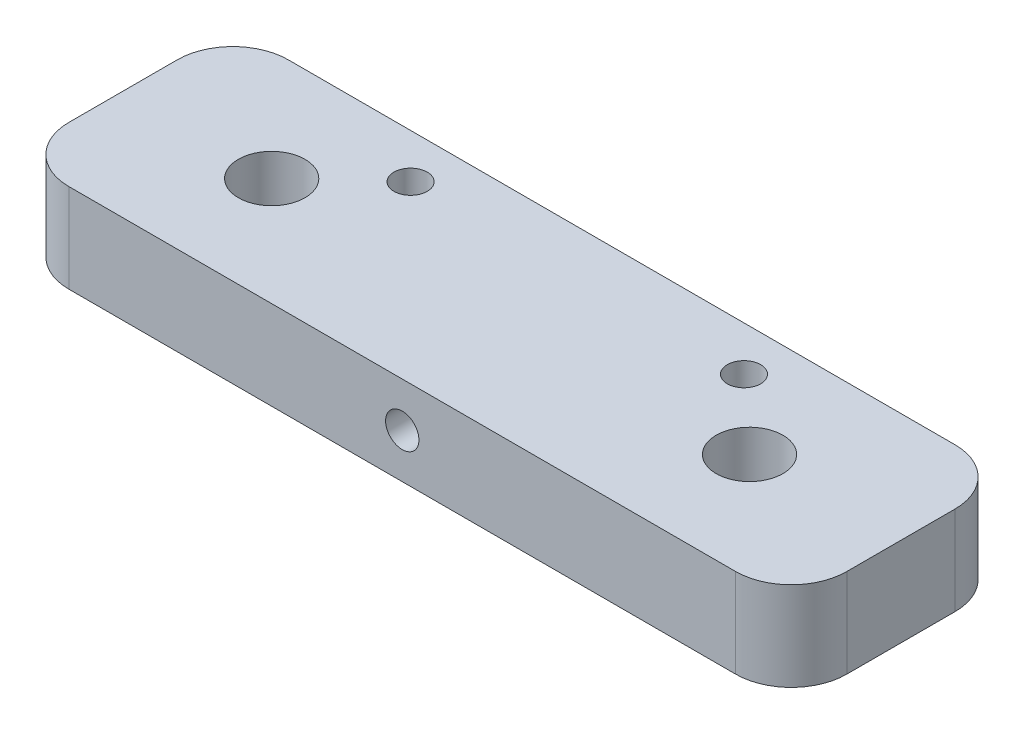
ISO-10303-21;
HEADER;
FILE_DESCRIPTION(('STEP AP214'),'2;1');
FILE_NAME('part.step','',(''),(''),'','','');
FILE_SCHEMA(('AUTOMOTIVE_DESIGN { 1 0 10303 214 1 1 1 1 }'));
ENDSEC;
DATA;
#1=APPLICATION_CONTEXT('core data for automotive mechanical design processes');
#2=APPLICATION_PROTOCOL_DEFINITION('international standard','automotive_design',2000,#1);
#3=PRODUCT_CONTEXT('',#1,'mechanical');
#4=PRODUCT('Part','Part','',(#3));
#5=PRODUCT_RELATED_PRODUCT_CATEGORY('part','',(#4));
#6=PRODUCT_DEFINITION_FORMATION('','',#4);
#7=PRODUCT_DEFINITION_CONTEXT('part definition',#1,'design');
#8=PRODUCT_DEFINITION('design','',#6,#7);
#9=PRODUCT_DEFINITION_SHAPE('','',#8);
#10=(LENGTH_UNIT() NAMED_UNIT(*) SI_UNIT(.MILLI.,.METRE.));
#11=(NAMED_UNIT(*) PLANE_ANGLE_UNIT() SI_UNIT($,.RADIAN.));
#12=(NAMED_UNIT(*) SI_UNIT($,.STERADIAN.) SOLID_ANGLE_UNIT());
#13=UNCERTAINTY_MEASURE_WITH_UNIT(LENGTH_MEASURE(1.E-05),#10,'distance_accuracy_value','');
#14=(GEOMETRIC_REPRESENTATION_CONTEXT(3) GLOBAL_UNCERTAINTY_ASSIGNED_CONTEXT((#13)) GLOBAL_UNIT_ASSIGNED_CONTEXT((#10,
#11,#12)) REPRESENTATION_CONTEXT('',''));
#15=CARTESIAN_POINT('',(0.,0.,0.));
#16=DIRECTION('',(0.,0.,1.));
#17=DIRECTION('',(1.,0.,0.));
#18=AXIS2_PLACEMENT_3D('',#15,#16,#17);
#19=CARTESIAN_POINT('',(0.,4.,9.875));
#20=DIRECTION('',(0.,0.,-1.));
#21=DIRECTION('',(-1.,0.,0.));
#22=AXIS2_PLACEMENT_3D('',#19,#20,#21);
#23=CYLINDRICAL_SURFACE('',#22,1.5);
#24=CARTESIAN_POINT('',(0.,4.,9.875));
#25=DIRECTION('',(0.,0.,-1.));
#26=DIRECTION('',(-1.,0.,0.));
#27=AXIS2_PLACEMENT_3D('',#24,#25,#26);
#28=CIRCLE('',#27,1.5);
#29=CARTESIAN_POINT('',(-1.5,4.,9.875));
#30=VERTEX_POINT('',#29);
#31=EDGE_CURVE('E231',#30,#30,#28,.T.);
#32=ORIENTED_EDGE('',*,*,#31,.F.);
#33=EDGE_LOOP('',(#32));
#34=FACE_BOUND('',#33,.T.);
#35=CARTESIAN_POINT('',(0.,4.,-7.875));
#36=DIRECTION('',(0.,0.,-1.));
#37=DIRECTION('',(-1.,0.,0.));
#38=AXIS2_PLACEMENT_3D('',#35,#36,#37);
#39=CIRCLE('',#38,1.5);
#40=CARTESIAN_POINT('',(-1.5,4.,-7.875));
#41=VERTEX_POINT('',#40);
#42=EDGE_CURVE('E45',#41,#41,#39,.F.);
#43=ORIENTED_EDGE('',*,*,#42,.F.);
#44=EDGE_LOOP('',(#43));
#45=FACE_BOUND('',#44,.T.);
#46=ADVANCED_FACE('F41',(#34,#45),#23,.F.);
#47=CARTESIAN_POINT('',(35.,8.,9.875));
#48=DIRECTION('',(-1.,0.,0.));
#49=DIRECTION('',(0.,0.,1.));
#50=AXIS2_PLACEMENT_3D('',#47,#48,#49);
#51=PLANE('',#50);
#52=DIRECTION('',(0.,0.,-1.));
#53=VECTOR('',#52,1.);
#54=CARTESIAN_POINT('',(35.,8.,9.875));
#55=LINE('',#54,#53);
#56=CARTESIAN_POINT('',(35.,8.,4.875));
#57=VERTEX_POINT('',#56);
#58=CARTESIAN_POINT('',(35.,8.,-4.875));
#59=VERTEX_POINT('',#58);
#60=EDGE_CURVE('E130',#57,#59,#55,.T.);
#61=ORIENTED_EDGE('',*,*,#60,.F.);
#62=DIRECTION('',(0.,-1.,0.));
#63=VECTOR('',#62,1.);
#64=CARTESIAN_POINT('',(35.,8.,4.875));
#65=LINE('',#64,#63);
#66=CARTESIAN_POINT('',(35.,0.,4.875));
#67=VERTEX_POINT('',#66);
#68=EDGE_CURVE('E113',#57,#67,#65,.T.);
#69=ORIENTED_EDGE('',*,*,#68,.T.);
#70=DIRECTION('',(0.,0.,-1.));
#71=VECTOR('',#70,1.);
#72=CARTESIAN_POINT('',(35.,0.,9.875));
#73=LINE('',#72,#71);
#74=CARTESIAN_POINT('',(35.,0.,-4.875));
#75=VERTEX_POINT('',#74);
#76=EDGE_CURVE('E127',#67,#75,#73,.T.);
#77=ORIENTED_EDGE('',*,*,#76,.T.);
#78=DIRECTION('',(0.,-1.,0.));
#79=VECTOR('',#78,1.);
#80=CARTESIAN_POINT('',(35.,8.,-4.875));
#81=LINE('',#80,#79);
#82=EDGE_CURVE('E133',#75,#59,#81,.F.);
#83=ORIENTED_EDGE('',*,*,#82,.T.);
#84=EDGE_LOOP('',(#61,#69,#77,#83));
#85=FACE_BOUND('',#84,.T.);
#86=ADVANCED_FACE('F126',(#85),#51,.F.);
#87=CARTESIAN_POINT('',(-35.,8.,-9.875));
#88=DIRECTION('',(0.,0.,1.));
#89=DIRECTION('',(1.,0.,0.));
#90=AXIS2_PLACEMENT_3D('',#87,#88,#89);
#91=PLANE('',#90);
#92=CARTESIAN_POINT('',(0.,4.,-9.875));
#93=DIRECTION('',(0.,0.,-1.));
#94=DIRECTION('',(-1.,0.,0.));
#95=AXIS2_PLACEMENT_3D('',#92,#93,#94);
#96=CIRCLE('',#95,3.5);
#97=CARTESIAN_POINT('',(-3.5,4.,-9.875));
#98=VERTEX_POINT('',#97);
#99=EDGE_CURVE('E245',#98,#98,#96,.T.);
#100=ORIENTED_EDGE('',*,*,#99,.F.);
#101=EDGE_LOOP('',(#100));
#102=FACE_BOUND('',#101,.T.);
#103=DIRECTION('',(-1.,0.,0.));
#104=VECTOR('',#103,1.);
#105=CARTESIAN_POINT('',(-35.,0.,-9.875));
#106=LINE('',#105,#104);
#107=CARTESIAN_POINT('',(30.,0.,-9.875));
#108=VERTEX_POINT('',#107);
#109=CARTESIAN_POINT('',(-30.,0.,-9.875));
#110=VERTEX_POINT('',#109);
#111=EDGE_CURVE('E138',#108,#110,#106,.T.);
#112=ORIENTED_EDGE('',*,*,#111,.T.);
#113=DIRECTION('',(0.,-1.,0.));
#114=VECTOR('',#113,1.);
#115=CARTESIAN_POINT('',(-30.,8.,-9.875));
#116=LINE('',#115,#114);
#117=CARTESIAN_POINT('',(-30.,8.,-9.875));
#118=VERTEX_POINT('',#117);
#119=EDGE_CURVE('E11',#110,#118,#116,.F.);
#120=ORIENTED_EDGE('',*,*,#119,.T.);
#121=DIRECTION('',(-1.,0.,0.));
#122=VECTOR('',#121,1.);
#123=CARTESIAN_POINT('',(-35.,8.,-9.875));
#124=LINE('',#123,#122);
#125=CARTESIAN_POINT('',(30.,8.,-9.875));
#126=VERTEX_POINT('',#125);
#127=EDGE_CURVE('E196',#126,#118,#124,.T.);
#128=ORIENTED_EDGE('',*,*,#127,.F.);
#129=DIRECTION('',(0.,-1.,0.));
#130=VECTOR('',#129,1.);
#131=CARTESIAN_POINT('',(30.,8.,-9.875));
#132=LINE('',#131,#130);
#133=EDGE_CURVE('E51',#126,#108,#132,.T.);
#134=ORIENTED_EDGE('',*,*,#133,.T.);
#135=EDGE_LOOP('',(#112,#120,#128,#134));
#136=FACE_BOUND('',#135,.T.);
#137=ADVANCED_FACE('F194',(#102,#136),#91,.F.);
#138=CARTESIAN_POINT('',(-35.,8.,9.875));
#139=DIRECTION('',(1.,0.,0.));
#140=DIRECTION('',(0.,0.,-1.));
#141=AXIS2_PLACEMENT_3D('',#138,#139,#140);
#142=PLANE('',#141);
#143=DIRECTION('',(0.,0.,1.));
#144=VECTOR('',#143,1.);
#145=CARTESIAN_POINT('',(-35.,0.,9.875));
#146=LINE('',#145,#144);
#147=CARTESIAN_POINT('',(-35.,0.,-4.875));
#148=VERTEX_POINT('',#147);
#149=CARTESIAN_POINT('',(-35.,0.,4.875));
#150=VERTEX_POINT('',#149);
#151=EDGE_CURVE('E144',#148,#150,#146,.T.);
#152=ORIENTED_EDGE('',*,*,#151,.T.);
#153=DIRECTION('',(0.,-1.,0.));
#154=VECTOR('',#153,1.);
#155=CARTESIAN_POINT('',(-35.,8.,4.875));
#156=LINE('',#155,#154);
#157=CARTESIAN_POINT('',(-35.,8.,4.875));
#158=VERTEX_POINT('',#157);
#159=EDGE_CURVE('E58',#150,#158,#156,.F.);
#160=ORIENTED_EDGE('',*,*,#159,.T.);
#161=DIRECTION('',(0.,0.,1.));
#162=VECTOR('',#161,1.);
#163=CARTESIAN_POINT('',(-35.,8.,9.875));
#164=LINE('',#163,#162);
#165=CARTESIAN_POINT('',(-35.,8.,-4.875));
#166=VERTEX_POINT('',#165);
#167=EDGE_CURVE('E204',#166,#158,#164,.T.);
#168=ORIENTED_EDGE('',*,*,#167,.F.);
#169=DIRECTION('',(0.,-1.,0.));
#170=VECTOR('',#169,1.);
#171=CARTESIAN_POINT('',(-35.,8.,-4.875));
#172=LINE('',#171,#170);
#173=EDGE_CURVE('E183',#166,#148,#172,.T.);
#174=ORIENTED_EDGE('',*,*,#173,.T.);
#175=EDGE_LOOP('',(#152,#160,#168,#174));
#176=FACE_BOUND('',#175,.T.);
#177=ADVANCED_FACE('F203',(#176),#142,.F.);
#178=CARTESIAN_POINT('',(-35.,8.,9.875));
#179=DIRECTION('',(0.,0.,-1.));
#180=DIRECTION('',(-1.,0.,0.));
#181=AXIS2_PLACEMENT_3D('',#178,#179,#180);
#182=PLANE('',#181);
#183=ORIENTED_EDGE('',*,*,#31,.T.);
#184=EDGE_LOOP('',(#183));
#185=FACE_BOUND('',#184,.T.);
#186=DIRECTION('',(1.,0.,0.));
#187=VECTOR('',#186,1.);
#188=CARTESIAN_POINT('',(-35.,0.,9.875));
#189=LINE('',#188,#187);
#190=CARTESIAN_POINT('',(-30.,0.,9.875));
#191=VERTEX_POINT('',#190);
#192=CARTESIAN_POINT('',(30.,0.,9.875));
#193=VERTEX_POINT('',#192);
#194=EDGE_CURVE('E155',#191,#193,#189,.T.);
#195=ORIENTED_EDGE('',*,*,#194,.T.);
#196=DIRECTION('',(0.,-1.,0.));
#197=VECTOR('',#196,1.);
#198=CARTESIAN_POINT('',(30.,8.,9.875));
#199=LINE('',#198,#197);
#200=CARTESIAN_POINT('',(30.,8.,9.875));
#201=VERTEX_POINT('',#200);
#202=EDGE_CURVE('E114',#193,#201,#199,.F.);
#203=ORIENTED_EDGE('',*,*,#202,.T.);
#204=DIRECTION('',(1.,0.,0.));
#205=VECTOR('',#204,1.);
#206=CARTESIAN_POINT('',(-35.,8.,9.875));
#207=LINE('',#206,#205);
#208=CARTESIAN_POINT('',(-30.,8.,9.875));
#209=VERTEX_POINT('',#208);
#210=EDGE_CURVE('E150',#209,#201,#207,.T.);
#211=ORIENTED_EDGE('',*,*,#210,.F.);
#212=DIRECTION('',(0.,-1.,0.));
#213=VECTOR('',#212,1.);
#214=CARTESIAN_POINT('',(-30.,8.,9.875));
#215=LINE('',#214,#213);
#216=EDGE_CURVE('E120',#209,#191,#215,.T.);
#217=ORIENTED_EDGE('',*,*,#216,.T.);
#218=EDGE_LOOP('',(#195,#203,#211,#217));
#219=FACE_BOUND('',#218,.T.);
#220=ADVANCED_FACE('F291',(#185,#219),#182,.F.);
#221=CARTESIAN_POINT('',(0.,8.,0.));
#222=DIRECTION('',(0.,-1.,0.));
#223=DIRECTION('',(0.,0.,-1.));
#224=AXIS2_PLACEMENT_3D('',#221,#222,#223);
#225=PLANE('',#224);
#226=CARTESIAN_POINT('',(-15.,8.,-5.875));
#227=DIRECTION('',(0.,1.,0.));
#228=DIRECTION('',(0.,0.,1.));
#229=AXIS2_PLACEMENT_3D('',#226,#227,#228);
#230=CIRCLE('',#229,1.5);
#231=CARTESIAN_POINT('',(-15.,8.,-4.375));
#232=VERTEX_POINT('',#231);
#233=EDGE_CURVE('E235',#232,#232,#230,.T.);
#234=ORIENTED_EDGE('',*,*,#233,.F.);
#235=EDGE_LOOP('',(#234));
#236=FACE_BOUND('',#235,.T.);
#237=CARTESIAN_POINT('',(15.,8.,-5.875));
#238=DIRECTION('',(0.,1.,0.));
#239=DIRECTION('',(0.,0.,-1.));
#240=AXIS2_PLACEMENT_3D('',#237,#238,#239);
#241=CIRCLE('',#240,1.5);
#242=CARTESIAN_POINT('',(15.,8.,-7.375));
#243=VERTEX_POINT('',#242);
#244=EDGE_CURVE('E226',#243,#243,#241,.T.);
#245=ORIENTED_EDGE('',*,*,#244,.F.);
#246=EDGE_LOOP('',(#245));
#247=FACE_BOUND('',#246,.T.);
#248=CARTESIAN_POINT('',(-21.5,8.,0.125));
#249=DIRECTION('',(0.,1.,0.));
#250=DIRECTION('',(0.,0.,1.));
#251=AXIS2_PLACEMENT_3D('',#248,#249,#250);
#252=CIRCLE('',#251,3.);
#253=CARTESIAN_POINT('',(-21.5,8.,3.125));
#254=VERTEX_POINT('',#253);
#255=EDGE_CURVE('E147',#254,#254,#252,.T.);
#256=ORIENTED_EDGE('',*,*,#255,.F.);
#257=EDGE_LOOP('',(#256));
#258=FACE_BOUND('',#257,.T.);
#259=CARTESIAN_POINT('',(21.5,8.,0.124999999999995));
#260=DIRECTION('',(0.,1.,0.));
#261=DIRECTION('',(0.,0.,-1.));
#262=AXIS2_PLACEMENT_3D('',#259,#260,#261);
#263=CIRCLE('',#262,3.);
#264=CARTESIAN_POINT('',(21.5,8.,-2.87500000000001));
#265=VERTEX_POINT('',#264);
#266=EDGE_CURVE('E214',#265,#265,#263,.T.);
#267=ORIENTED_EDGE('',*,*,#266,.F.);
#268=EDGE_LOOP('',(#267));
#269=FACE_BOUND('',#268,.T.);
#270=ORIENTED_EDGE('',*,*,#210,.T.);
#271=CARTESIAN_POINT('',(30.,8.,4.875));
#272=DIRECTION('',(0.,-1.,0.));
#273=DIRECTION('',(0.,0.,-1.));
#274=AXIS2_PLACEMENT_3D('',#271,#272,#273);
#275=CIRCLE('',#274,5.);
#276=EDGE_CURVE('E180',#201,#57,#275,.F.);
#277=ORIENTED_EDGE('',*,*,#276,.T.);
#278=ORIENTED_EDGE('',*,*,#60,.T.);
#279=CARTESIAN_POINT('',(30.,8.,-4.875));
#280=DIRECTION('',(0.,-1.,0.));
#281=DIRECTION('',(0.,0.,-1.));
#282=AXIS2_PLACEMENT_3D('',#279,#280,#281);
#283=CIRCLE('',#282,5.);
#284=EDGE_CURVE('E172',#59,#126,#283,.F.);
#285=ORIENTED_EDGE('',*,*,#284,.T.);
#286=ORIENTED_EDGE('',*,*,#127,.T.);
#287=CARTESIAN_POINT('',(-30.,8.,-4.875));
#288=DIRECTION('',(0.,-1.,0.));
#289=DIRECTION('',(0.,0.,-1.));
#290=AXIS2_PLACEMENT_3D('',#287,#288,#289);
#291=CIRCLE('',#290,5.);
#292=EDGE_CURVE('E65',#118,#166,#291,.F.);
#293=ORIENTED_EDGE('',*,*,#292,.T.);
#294=ORIENTED_EDGE('',*,*,#167,.T.);
#295=CARTESIAN_POINT('',(-30.,8.,4.875));
#296=DIRECTION('',(0.,-1.,0.));
#297=DIRECTION('',(0.,0.,-1.));
#298=AXIS2_PLACEMENT_3D('',#295,#296,#297);
#299=CIRCLE('',#298,5.);
#300=EDGE_CURVE('E177',#158,#209,#299,.F.);
#301=ORIENTED_EDGE('',*,*,#300,.T.);
#302=EDGE_LOOP('',(#270,#277,#278,#285,#286,#293,#294,#301));
#303=FACE_BOUND('',#302,.T.);
#304=ADVANCED_FACE('F288',(#236,#247,#258,#269,#303),#225,.F.);
#305=CARTESIAN_POINT('',(0.,0.,0.));
#306=DIRECTION('',(0.,-1.,0.));
#307=DIRECTION('',(0.,0.,-1.));
#308=AXIS2_PLACEMENT_3D('',#305,#306,#307);
#309=PLANE('',#308);
#310=CARTESIAN_POINT('',(-15.,0.,-5.875));
#311=DIRECTION('',(0.,1.,0.));
#312=DIRECTION('',(0.,0.,1.));
#313=AXIS2_PLACEMENT_3D('',#310,#311,#312);
#314=CIRCLE('',#313,1.5);
#315=CARTESIAN_POINT('',(-15.,0.,-4.375));
#316=VERTEX_POINT('',#315);
#317=EDGE_CURVE('E219',#316,#316,#314,.T.);
#318=ORIENTED_EDGE('',*,*,#317,.T.);
#319=EDGE_LOOP('',(#318));
#320=FACE_BOUND('',#319,.T.);
#321=CARTESIAN_POINT('',(15.,0.,-5.875));
#322=DIRECTION('',(0.,1.,0.));
#323=DIRECTION('',(0.,0.,-1.));
#324=AXIS2_PLACEMENT_3D('',#321,#322,#323);
#325=CIRCLE('',#324,1.5);
#326=CARTESIAN_POINT('',(15.,0.,-7.375));
#327=VERTEX_POINT('',#326);
#328=EDGE_CURVE('E230',#327,#327,#325,.T.);
#329=ORIENTED_EDGE('',*,*,#328,.T.);
#330=EDGE_LOOP('',(#329));
#331=FACE_BOUND('',#330,.T.);
#332=CARTESIAN_POINT('',(-21.5,0.,0.125));
#333=DIRECTION('',(0.,1.,0.));
#334=DIRECTION('',(0.,0.,1.));
#335=AXIS2_PLACEMENT_3D('',#332,#333,#334);
#336=CIRCLE('',#335,3.);
#337=CARTESIAN_POINT('',(-21.5,0.,3.125));
#338=VERTEX_POINT('',#337);
#339=EDGE_CURVE('E139',#338,#338,#336,.T.);
#340=ORIENTED_EDGE('',*,*,#339,.T.);
#341=EDGE_LOOP('',(#340));
#342=FACE_BOUND('',#341,.T.);
#343=CARTESIAN_POINT('',(21.5,0.,0.124999999999995));
#344=DIRECTION('',(0.,1.,0.));
#345=DIRECTION('',(0.,0.,-1.));
#346=AXIS2_PLACEMENT_3D('',#343,#344,#345);
#347=CIRCLE('',#346,3.);
#348=CARTESIAN_POINT('',(21.5,0.,-2.87500000000001));
#349=VERTEX_POINT('',#348);
#350=EDGE_CURVE('E218',#349,#349,#347,.T.);
#351=ORIENTED_EDGE('',*,*,#350,.T.);
#352=EDGE_LOOP('',(#351));
#353=FACE_BOUND('',#352,.T.);
#354=ORIENTED_EDGE('',*,*,#76,.F.);
#355=CARTESIAN_POINT('',(30.,0.,4.875));
#356=DIRECTION('',(0.,-1.,0.));
#357=DIRECTION('',(0.,0.,-1.));
#358=AXIS2_PLACEMENT_3D('',#355,#356,#357);
#359=CIRCLE('',#358,5.);
#360=EDGE_CURVE('E109',#67,#193,#359,.T.);
#361=ORIENTED_EDGE('',*,*,#360,.T.);
#362=ORIENTED_EDGE('',*,*,#194,.F.);
#363=CARTESIAN_POINT('',(-30.,0.,4.875));
#364=DIRECTION('',(0.,-1.,0.));
#365=DIRECTION('',(0.,0.,-1.));
#366=AXIS2_PLACEMENT_3D('',#363,#364,#365);
#367=CIRCLE('',#366,5.);
#368=EDGE_CURVE('E121',#191,#150,#367,.T.);
#369=ORIENTED_EDGE('',*,*,#368,.T.);
#370=ORIENTED_EDGE('',*,*,#151,.F.);
#371=CARTESIAN_POINT('',(-30.,0.,-4.875));
#372=DIRECTION('',(0.,-1.,0.));
#373=DIRECTION('',(0.,0.,-1.));
#374=AXIS2_PLACEMENT_3D('',#371,#372,#373);
#375=CIRCLE('',#374,5.);
#376=EDGE_CURVE('E162',#148,#110,#375,.T.);
#377=ORIENTED_EDGE('',*,*,#376,.T.);
#378=ORIENTED_EDGE('',*,*,#111,.F.);
#379=CARTESIAN_POINT('',(30.,0.,-4.875));
#380=DIRECTION('',(0.,-1.,0.));
#381=DIRECTION('',(0.,0.,-1.));
#382=AXIS2_PLACEMENT_3D('',#379,#380,#381);
#383=CIRCLE('',#382,5.);
#384=EDGE_CURVE('E132',#108,#75,#383,.T.);
#385=ORIENTED_EDGE('',*,*,#384,.T.);
#386=EDGE_LOOP('',(#354,#361,#362,#369,#370,#377,#378,#385));
#387=FACE_BOUND('',#386,.T.);
#388=ADVANCED_FACE('F135',(#320,#331,#342,#353,#387),#309,.T.);
#389=CARTESIAN_POINT('',(21.5,0.,0.124999999999995));
#390=DIRECTION('',(0.,1.,0.));
#391=DIRECTION('',(0.,0.,1.));
#392=AXIS2_PLACEMENT_3D('',#389,#390,#391);
#393=CYLINDRICAL_SURFACE('',#392,3.);
#394=ORIENTED_EDGE('',*,*,#350,.F.);
#395=EDGE_LOOP('',(#394));
#396=FACE_BOUND('',#395,.T.);
#397=ORIENTED_EDGE('',*,*,#266,.T.);
#398=EDGE_LOOP('',(#397));
#399=FACE_BOUND('',#398,.T.);
#400=ADVANCED_FACE('F283',(#396,#399),#393,.F.);
#401=CARTESIAN_POINT('',(-21.5,0.,0.125));
#402=DIRECTION('',(0.,1.,0.));
#403=DIRECTION('',(0.,0.,1.));
#404=AXIS2_PLACEMENT_3D('',#401,#402,#403);
#405=CYLINDRICAL_SURFACE('',#404,3.);
#406=ORIENTED_EDGE('',*,*,#339,.F.);
#407=EDGE_LOOP('',(#406));
#408=FACE_BOUND('',#407,.T.);
#409=ORIENTED_EDGE('',*,*,#255,.T.);
#410=EDGE_LOOP('',(#409));
#411=FACE_BOUND('',#410,.T.);
#412=ADVANCED_FACE('F279',(#408,#411),#405,.F.);
#413=CARTESIAN_POINT('',(15.,0.,-5.875));
#414=DIRECTION('',(0.,1.,0.));
#415=DIRECTION('',(0.,0.,1.));
#416=AXIS2_PLACEMENT_3D('',#413,#414,#415);
#417=CYLINDRICAL_SURFACE('',#416,1.5);
#418=ORIENTED_EDGE('',*,*,#328,.F.);
#419=EDGE_LOOP('',(#418));
#420=FACE_BOUND('',#419,.T.);
#421=ORIENTED_EDGE('',*,*,#244,.T.);
#422=EDGE_LOOP('',(#421));
#423=FACE_BOUND('',#422,.T.);
#424=ADVANCED_FACE('F275',(#420,#423),#417,.F.);
#425=CARTESIAN_POINT('',(-15.,0.,-5.875));
#426=DIRECTION('',(0.,1.,0.));
#427=DIRECTION('',(0.,0.,1.));
#428=AXIS2_PLACEMENT_3D('',#425,#426,#427);
#429=CYLINDRICAL_SURFACE('',#428,1.5);
#430=ORIENTED_EDGE('',*,*,#317,.F.);
#431=EDGE_LOOP('',(#430));
#432=FACE_BOUND('',#431,.T.);
#433=ORIENTED_EDGE('',*,*,#233,.T.);
#434=EDGE_LOOP('',(#433));
#435=FACE_BOUND('',#434,.T.);
#436=ADVANCED_FACE('F272',(#432,#435),#429,.F.);
#437=CARTESIAN_POINT('',(30.,8.,4.875));
#438=DIRECTION('',(0.,-1.,0.));
#439=DIRECTION('',(0.,0.,-1.));
#440=AXIS2_PLACEMENT_3D('',#437,#438,#439);
#441=CYLINDRICAL_SURFACE('',#440,5.);
#442=ORIENTED_EDGE('',*,*,#276,.F.);
#443=ORIENTED_EDGE('',*,*,#202,.F.);
#444=ORIENTED_EDGE('',*,*,#360,.F.);
#445=ORIENTED_EDGE('',*,*,#68,.F.);
#446=EDGE_LOOP('',(#442,#443,#444,#445));
#447=FACE_BOUND('',#446,.T.);
#448=ADVANCED_FACE('F112',(#447),#441,.T.);
#449=CARTESIAN_POINT('',(-30.,8.,4.875));
#450=DIRECTION('',(0.,-1.,0.));
#451=DIRECTION('',(0.,0.,-1.));
#452=AXIS2_PLACEMENT_3D('',#449,#450,#451);
#453=CYLINDRICAL_SURFACE('',#452,5.);
#454=ORIENTED_EDGE('',*,*,#300,.F.);
#455=ORIENTED_EDGE('',*,*,#159,.F.);
#456=ORIENTED_EDGE('',*,*,#368,.F.);
#457=ORIENTED_EDGE('',*,*,#216,.F.);
#458=EDGE_LOOP('',(#454,#455,#456,#457));
#459=FACE_BOUND('',#458,.T.);
#460=ADVANCED_FACE('F306',(#459),#453,.T.);
#461=CARTESIAN_POINT('',(-30.,8.,-4.875));
#462=DIRECTION('',(0.,-1.,0.));
#463=DIRECTION('',(0.,0.,-1.));
#464=AXIS2_PLACEMENT_3D('',#461,#462,#463);
#465=CYLINDRICAL_SURFACE('',#464,5.);
#466=ORIENTED_EDGE('',*,*,#292,.F.);
#467=ORIENTED_EDGE('',*,*,#119,.F.);
#468=ORIENTED_EDGE('',*,*,#376,.F.);
#469=ORIENTED_EDGE('',*,*,#173,.F.);
#470=EDGE_LOOP('',(#466,#467,#468,#469));
#471=FACE_BOUND('',#470,.T.);
#472=ADVANCED_FACE('F202',(#471),#465,.T.);
#473=CARTESIAN_POINT('',(30.,8.,-4.875));
#474=DIRECTION('',(0.,-1.,0.));
#475=DIRECTION('',(0.,0.,-1.));
#476=AXIS2_PLACEMENT_3D('',#473,#474,#475);
#477=CYLINDRICAL_SURFACE('',#476,5.);
#478=ORIENTED_EDGE('',*,*,#284,.F.);
#479=ORIENTED_EDGE('',*,*,#82,.F.);
#480=ORIENTED_EDGE('',*,*,#384,.F.);
#481=ORIENTED_EDGE('',*,*,#133,.F.);
#482=EDGE_LOOP('',(#478,#479,#480,#481));
#483=FACE_BOUND('',#482,.T.);
#484=ADVANCED_FACE('F43',(#483),#477,.T.);
#485=CARTESIAN_POINT('',(0.,4.,-7.875));
#486=DIRECTION('',(0.,0.,-1.));
#487=DIRECTION('',(-1.,0.,0.));
#488=AXIS2_PLACEMENT_3D('',#485,#486,#487);
#489=PLANE('',#488);
#490=CARTESIAN_POINT('',(0.,4.,-7.875));
#491=DIRECTION('',(0.,0.,-1.));
#492=DIRECTION('',(-1.,0.,0.));
#493=AXIS2_PLACEMENT_3D('',#490,#491,#492);
#494=CIRCLE('',#493,3.5);
#495=CARTESIAN_POINT('',(-3.5,4.,-7.875));
#496=VERTEX_POINT('',#495);
#497=EDGE_CURVE('E249',#496,#496,#494,.T.);
#498=ORIENTED_EDGE('',*,*,#497,.T.);
#499=EDGE_LOOP('',(#498));
#500=FACE_BOUND('',#499,.T.);
#501=ORIENTED_EDGE('',*,*,#42,.T.);
#502=EDGE_LOOP('',(#501));
#503=FACE_BOUND('',#502,.T.);
#504=ADVANCED_FACE('F258',(#500,#503),#489,.T.);
#505=CARTESIAN_POINT('',(0.,4.,-7.875));
#506=DIRECTION('',(0.,0.,-1.));
#507=DIRECTION('',(-1.,0.,0.));
#508=AXIS2_PLACEMENT_3D('',#505,#506,#507);
#509=CYLINDRICAL_SURFACE('',#508,3.5);
#510=ORIENTED_EDGE('',*,*,#497,.F.);
#511=EDGE_LOOP('',(#510));
#512=FACE_BOUND('',#511,.T.);
#513=ORIENTED_EDGE('',*,*,#99,.T.);
#514=EDGE_LOOP('',(#513));
#515=FACE_BOUND('',#514,.T.);
#516=ADVANCED_FACE('F270',(#512,#515),#509,.F.);
#517=CLOSED_SHELL('',(#46,#86,#137,#177,#220,#304,#388,#400,#412,#424,#436,#448,#460,#472,#484,
#504,#516));
#518=MANIFOLD_SOLID_BREP('B2',#517);
#519=ADVANCED_BREP_SHAPE_REPRESENTATION('',(#18,#518),#14);
#520=SHAPE_DEFINITION_REPRESENTATION(#9,#519);
ENDSEC;
END-ISO-10303-21;
